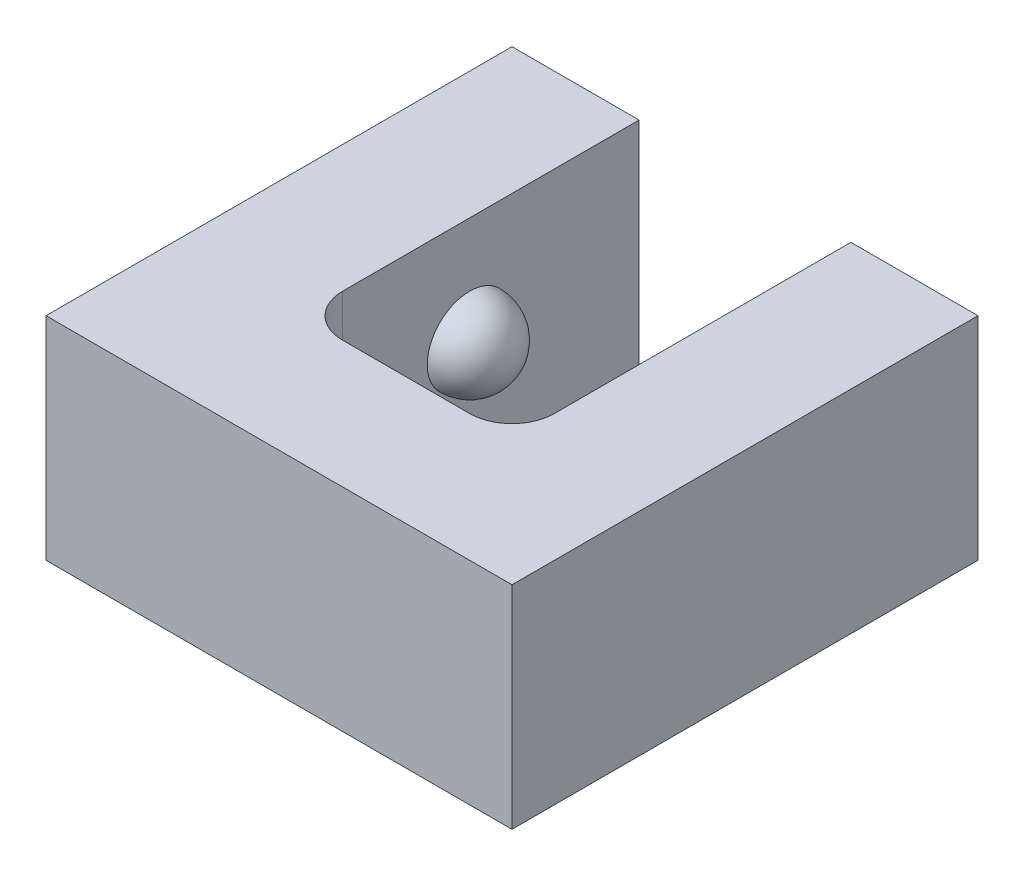
ISO-10303-21;
HEADER;
FILE_DESCRIPTION(('STEP AP214'),'2;1');
FILE_NAME('part.step','',(''),(''),'','','');
FILE_SCHEMA(('AUTOMOTIVE_DESIGN { 1 0 10303 214 1 1 1 1 }'));
ENDSEC;
DATA;
#1=APPLICATION_CONTEXT('core data for automotive mechanical design processes');
#2=APPLICATION_PROTOCOL_DEFINITION('international standard','automotive_design',2000,#1);
#3=PRODUCT_CONTEXT('',#1,'mechanical');
#4=PRODUCT('Part','Part','',(#3));
#5=PRODUCT_RELATED_PRODUCT_CATEGORY('part','',(#4));
#6=PRODUCT_DEFINITION_FORMATION('','',#4);
#7=PRODUCT_DEFINITION_CONTEXT('part definition',#1,'design');
#8=PRODUCT_DEFINITION('design','',#6,#7);
#9=PRODUCT_DEFINITION_SHAPE('','',#8);
#10=(LENGTH_UNIT() NAMED_UNIT(*) SI_UNIT(.MILLI.,.METRE.));
#11=(NAMED_UNIT(*) PLANE_ANGLE_UNIT() SI_UNIT($,.RADIAN.));
#12=(NAMED_UNIT(*) SI_UNIT($,.STERADIAN.) SOLID_ANGLE_UNIT());
#13=UNCERTAINTY_MEASURE_WITH_UNIT(LENGTH_MEASURE(1.E-05),#10,'distance_accuracy_value','');
#14=(GEOMETRIC_REPRESENTATION_CONTEXT(3) GLOBAL_UNCERTAINTY_ASSIGNED_CONTEXT((#13)) GLOBAL_UNIT_ASSIGNED_CONTEXT((#10,
#11,#12)) REPRESENTATION_CONTEXT('',''));
#15=CARTESIAN_POINT('',(0.,0.,0.));
#16=DIRECTION('',(0.,0.,1.));
#17=DIRECTION('',(1.,0.,0.));
#18=AXIS2_PLACEMENT_3D('',#15,#16,#17);
#19=CARTESIAN_POINT('',(-5.5,5.,0.));
#20=DIRECTION('',(-1.,0.,0.));
#21=DIRECTION('',(0.,0.,1.));
#22=AXIS2_PLACEMENT_3D('',#19,#20,#21);
#23=PLANE('',#22);
#24=DIRECTION('',(0.,0.,-1.));
#25=VECTOR('',#24,1.);
#26=CARTESIAN_POINT('',(-5.5,0.,0.));
#27=LINE('',#26,#25);
#28=CARTESIAN_POINT('',(-5.5,0.,5.5));
#29=VERTEX_POINT('',#28);
#30=CARTESIAN_POINT('',(-5.5,0.,-5.5));
#31=VERTEX_POINT('',#30);
#32=EDGE_CURVE('E129',#29,#31,#27,.T.);
#33=ORIENTED_EDGE('',*,*,#32,.F.);
#34=DIRECTION('',(0.,-1.,0.));
#35=VECTOR('',#34,1.);
#36=CARTESIAN_POINT('',(-5.5,5.,5.5));
#37=LINE('',#36,#35);
#38=CARTESIAN_POINT('',(-5.5,5.,5.5));
#39=VERTEX_POINT('',#38);
#40=EDGE_CURVE('E123',#39,#29,#37,.T.);
#41=ORIENTED_EDGE('',*,*,#40,.F.);
#42=DIRECTION('',(0.,0.,-1.));
#43=VECTOR('',#42,1.);
#44=CARTESIAN_POINT('',(-5.5,5.,0.));
#45=LINE('',#44,#43);
#46=CARTESIAN_POINT('',(-5.5,5.,-5.5));
#47=VERTEX_POINT('',#46);
#48=EDGE_CURVE('E126',#39,#47,#45,.T.);
#49=ORIENTED_EDGE('',*,*,#48,.T.);
#50=DIRECTION('',(0.,-1.,0.));
#51=VECTOR('',#50,1.);
#52=CARTESIAN_POINT('',(-5.5,5.,-5.5));
#53=LINE('',#52,#51);
#54=EDGE_CURVE('E177',#47,#31,#53,.T.);
#55=ORIENTED_EDGE('',*,*,#54,.T.);
#56=EDGE_LOOP('',(#33,#41,#49,#55));
#57=FACE_BOUND('',#56,.T.);
#58=ADVANCED_FACE('F47',(#57),#23,.T.);
#59=CARTESIAN_POINT('',(0.,5.,5.5));
#60=DIRECTION('',(0.,0.,-1.));
#61=DIRECTION('',(-1.,0.,0.));
#62=AXIS2_PLACEMENT_3D('',#59,#60,#61);
#63=PLANE('',#62);
#64=DIRECTION('',(1.,0.,0.));
#65=VECTOR('',#64,1.);
#66=CARTESIAN_POINT('',(0.,0.,5.5));
#67=LINE('',#66,#65);
#68=CARTESIAN_POINT('',(5.5,0.,5.5));
#69=VERTEX_POINT('',#68);
#70=EDGE_CURVE('E164',#29,#69,#67,.T.);
#71=ORIENTED_EDGE('',*,*,#70,.T.);
#72=DIRECTION('',(0.,-1.,0.));
#73=VECTOR('',#72,1.);
#74=CARTESIAN_POINT('',(5.5,5.,5.5));
#75=LINE('',#74,#73);
#76=CARTESIAN_POINT('',(5.5,5.,5.5));
#77=VERTEX_POINT('',#76);
#78=EDGE_CURVE('E133',#77,#69,#75,.T.);
#79=ORIENTED_EDGE('',*,*,#78,.F.);
#80=DIRECTION('',(1.,0.,0.));
#81=VECTOR('',#80,1.);
#82=CARTESIAN_POINT('',(0.,5.,5.5));
#83=LINE('',#82,#81);
#84=EDGE_CURVE('E136',#39,#77,#83,.T.);
#85=ORIENTED_EDGE('',*,*,#84,.F.);
#86=ORIENTED_EDGE('',*,*,#40,.T.);
#87=EDGE_LOOP('',(#71,#79,#85,#86));
#88=FACE_BOUND('',#87,.T.);
#89=ADVANCED_FACE('F137',(#88),#63,.F.);
#90=CARTESIAN_POINT('',(5.5,5.,0.));
#91=DIRECTION('',(-1.,0.,0.));
#92=DIRECTION('',(0.,0.,1.));
#93=AXIS2_PLACEMENT_3D('',#90,#91,#92);
#94=PLANE('',#93);
#95=DIRECTION('',(0.,0.,-1.));
#96=VECTOR('',#95,1.);
#97=CARTESIAN_POINT('',(5.5,0.,0.));
#98=LINE('',#97,#96);
#99=CARTESIAN_POINT('',(5.5,0.,-5.5));
#100=VERTEX_POINT('',#99);
#101=EDGE_CURVE('E167',#69,#100,#98,.T.);
#102=ORIENTED_EDGE('',*,*,#101,.T.);
#103=DIRECTION('',(0.,-1.,0.));
#104=VECTOR('',#103,1.);
#105=CARTESIAN_POINT('',(5.5,5.,-5.5));
#106=LINE('',#105,#104);
#107=CARTESIAN_POINT('',(5.5,5.,-5.5));
#108=VERTEX_POINT('',#107);
#109=EDGE_CURVE('E185',#108,#100,#106,.T.);
#110=ORIENTED_EDGE('',*,*,#109,.F.);
#111=DIRECTION('',(0.,0.,-1.));
#112=VECTOR('',#111,1.);
#113=CARTESIAN_POINT('',(5.5,5.,0.));
#114=LINE('',#113,#112);
#115=EDGE_CURVE('E140',#77,#108,#114,.T.);
#116=ORIENTED_EDGE('',*,*,#115,.F.);
#117=ORIENTED_EDGE('',*,*,#78,.T.);
#118=EDGE_LOOP('',(#102,#110,#116,#117));
#119=FACE_BOUND('',#118,.T.);
#120=ADVANCED_FACE('F219',(#119),#94,.F.);
#121=CARTESIAN_POINT('',(0.,5.,-5.5));
#122=DIRECTION('',(0.,0.,-1.));
#123=DIRECTION('',(-1.,0.,0.));
#124=AXIS2_PLACEMENT_3D('',#121,#122,#123);
#125=PLANE('',#124);
#126=DIRECTION('',(1.,0.,0.));
#127=VECTOR('',#126,1.);
#128=CARTESIAN_POINT('',(0.,0.,-5.5));
#129=LINE('',#128,#127);
#130=CARTESIAN_POINT('',(2.5,0.,-5.5));
#131=VERTEX_POINT('',#130);
#132=EDGE_CURVE('E150',#131,#100,#129,.T.);
#133=ORIENTED_EDGE('',*,*,#132,.F.);
#134=DIRECTION('',(0.,-1.,0.));
#135=VECTOR('',#134,1.);
#136=CARTESIAN_POINT('',(2.5,5.,-5.5));
#137=LINE('',#136,#135);
#138=CARTESIAN_POINT('',(2.5,5.,-5.5));
#139=VERTEX_POINT('',#138);
#140=EDGE_CURVE('E182',#139,#131,#137,.T.);
#141=ORIENTED_EDGE('',*,*,#140,.F.);
#142=DIRECTION('',(1.,0.,0.));
#143=VECTOR('',#142,1.);
#144=CARTESIAN_POINT('',(0.,5.,-5.5));
#145=LINE('',#144,#143);
#146=EDGE_CURVE('E153',#139,#108,#145,.T.);
#147=ORIENTED_EDGE('',*,*,#146,.T.);
#148=ORIENTED_EDGE('',*,*,#109,.T.);
#149=EDGE_LOOP('',(#133,#141,#147,#148));
#150=FACE_BOUND('',#149,.T.);
#151=ADVANCED_FACE('F227',(#150),#125,.T.);
#152=CARTESIAN_POINT('',(2.5,5.,0.));
#153=DIRECTION('',(-1.,0.,0.));
#154=DIRECTION('',(0.,0.,1.));
#155=AXIS2_PLACEMENT_3D('',#152,#153,#154);
#156=PLANE('',#155);
#157=CARTESIAN_POINT('',(2.5,2.5,-1.5));
#158=DIRECTION('',(-1.,0.,0.));
#159=DIRECTION('',(0.,0.,1.));
#160=AXIS2_PLACEMENT_3D('',#157,#158,#159);
#161=CIRCLE('',#160,1.);
#162=CARTESIAN_POINT('',(2.5,2.5,-0.5));
#163=VERTEX_POINT('',#162);
#164=EDGE_CURVE('E165',#163,#163,#161,.F.);
#165=ORIENTED_EDGE('',*,*,#164,.T.);
#166=EDGE_LOOP('',(#165));
#167=FACE_BOUND('',#166,.T.);
#168=DIRECTION('',(0.,0.,-1.));
#169=VECTOR('',#168,1.);
#170=CARTESIAN_POINT('',(2.5,0.,0.));
#171=LINE('',#170,#169);
#172=CARTESIAN_POINT('',(2.5,0.,1.5));
#173=VERTEX_POINT('',#172);
#174=EDGE_CURVE('E171',#173,#131,#171,.T.);
#175=ORIENTED_EDGE('',*,*,#174,.F.);
#176=DIRECTION('',(0.,-1.,0.));
#177=VECTOR('',#176,1.);
#178=CARTESIAN_POINT('',(2.5,5.,1.5));
#179=LINE('',#178,#177);
#180=CARTESIAN_POINT('',(2.5,5.,1.5));
#181=VERTEX_POINT('',#180);
#182=EDGE_CURVE('E197',#173,#181,#179,.F.);
#183=ORIENTED_EDGE('',*,*,#182,.T.);
#184=DIRECTION('',(0.,0.,-1.));
#185=VECTOR('',#184,1.);
#186=CARTESIAN_POINT('',(2.5,5.,0.));
#187=LINE('',#186,#185);
#188=EDGE_CURVE('E156',#181,#139,#187,.T.);
#189=ORIENTED_EDGE('',*,*,#188,.T.);
#190=ORIENTED_EDGE('',*,*,#140,.T.);
#191=EDGE_LOOP('',(#175,#183,#189,#190));
#192=FACE_BOUND('',#191,.T.);
#193=ADVANCED_FACE('F230',(#167,#192),#156,.T.);
#194=CARTESIAN_POINT('',(0.,5.,2.5));
#195=DIRECTION('',(0.,0.,-1.));
#196=DIRECTION('',(-1.,0.,0.));
#197=AXIS2_PLACEMENT_3D('',#194,#195,#196);
#198=PLANE('',#197);
#199=DIRECTION('',(1.,0.,0.));
#200=VECTOR('',#199,1.);
#201=CARTESIAN_POINT('',(0.,5.,2.5));
#202=LINE('',#201,#200);
#203=CARTESIAN_POINT('',(-1.5,5.,2.5));
#204=VERTEX_POINT('',#203);
#205=CARTESIAN_POINT('',(1.5,5.,2.5));
#206=VERTEX_POINT('',#205);
#207=EDGE_CURVE('E158',#204,#206,#202,.T.);
#208=ORIENTED_EDGE('',*,*,#207,.T.);
#209=DIRECTION('',(0.,-1.,0.));
#210=VECTOR('',#209,1.);
#211=CARTESIAN_POINT('',(1.5,0.,2.5));
#212=LINE('',#211,#210);
#213=CARTESIAN_POINT('',(1.5,0.,2.5));
#214=VERTEX_POINT('',#213);
#215=EDGE_CURVE('E194',#206,#214,#212,.T.);
#216=ORIENTED_EDGE('',*,*,#215,.T.);
#217=DIRECTION('',(1.,0.,0.));
#218=VECTOR('',#217,1.);
#219=CARTESIAN_POINT('',(0.,0.,2.5));
#220=LINE('',#219,#218);
#221=CARTESIAN_POINT('',(-1.5,0.,2.5));
#222=VERTEX_POINT('',#221);
#223=EDGE_CURVE('E173',#222,#214,#220,.T.);
#224=ORIENTED_EDGE('',*,*,#223,.F.);
#225=DIRECTION('',(0.,-1.,0.));
#226=VECTOR('',#225,1.);
#227=CARTESIAN_POINT('',(-1.5,5.,2.5));
#228=LINE('',#227,#226);
#229=EDGE_CURVE('E190',#222,#204,#228,.F.);
#230=ORIENTED_EDGE('',*,*,#229,.T.);
#231=EDGE_LOOP('',(#208,#216,#224,#230));
#232=FACE_BOUND('',#231,.T.);
#233=ADVANCED_FACE('F209',(#232),#198,.T.);
#234=CARTESIAN_POINT('',(-2.5,5.,0.));
#235=DIRECTION('',(-1.,0.,0.));
#236=DIRECTION('',(0.,0.,1.));
#237=AXIS2_PLACEMENT_3D('',#234,#235,#236);
#238=PLANE('',#237);
#239=CARTESIAN_POINT('',(-2.5,2.5,-1.5));
#240=DIRECTION('',(-1.,0.,0.));
#241=DIRECTION('',(0.,0.,1.));
#242=AXIS2_PLACEMENT_3D('',#239,#240,#241);
#243=CIRCLE('',#242,1.);
#244=CARTESIAN_POINT('',(-2.5,2.5,-0.5));
#245=VERTEX_POINT('',#244);
#246=EDGE_CURVE('E132',#245,#245,#243,.F.);
#247=ORIENTED_EDGE('',*,*,#246,.F.);
#248=EDGE_LOOP('',(#247));
#249=FACE_BOUND('',#248,.T.);
#250=DIRECTION('',(0.,0.,-1.));
#251=VECTOR('',#250,1.);
#252=CARTESIAN_POINT('',(-2.5,5.,0.));
#253=LINE('',#252,#251);
#254=CARTESIAN_POINT('',(-2.5,5.,1.5));
#255=VERTEX_POINT('',#254);
#256=CARTESIAN_POINT('',(-2.5,5.,-5.5));
#257=VERTEX_POINT('',#256);
#258=EDGE_CURVE('E161',#255,#257,#253,.T.);
#259=ORIENTED_EDGE('',*,*,#258,.F.);
#260=DIRECTION('',(0.,-1.,0.));
#261=VECTOR('',#260,1.);
#262=CARTESIAN_POINT('',(-2.5,5.,1.5));
#263=LINE('',#262,#261);
#264=CARTESIAN_POINT('',(-2.5,0.,1.5));
#265=VERTEX_POINT('',#264);
#266=EDGE_CURVE('E199',#255,#265,#263,.T.);
#267=ORIENTED_EDGE('',*,*,#266,.T.);
#268=DIRECTION('',(0.,0.,-1.));
#269=VECTOR('',#268,1.);
#270=CARTESIAN_POINT('',(-2.5,0.,0.));
#271=LINE('',#270,#269);
#272=CARTESIAN_POINT('',(-2.5,0.,-5.5));
#273=VERTEX_POINT('',#272);
#274=EDGE_CURVE('E148',#265,#273,#271,.T.);
#275=ORIENTED_EDGE('',*,*,#274,.T.);
#276=DIRECTION('',(0.,-1.,0.));
#277=VECTOR('',#276,1.);
#278=CARTESIAN_POINT('',(-2.5,5.,-5.5));
#279=LINE('',#278,#277);
#280=EDGE_CURVE('E179',#257,#273,#279,.T.);
#281=ORIENTED_EDGE('',*,*,#280,.F.);
#282=EDGE_LOOP('',(#259,#267,#275,#281));
#283=FACE_BOUND('',#282,.T.);
#284=ADVANCED_FACE('F212',(#249,#283),#238,.F.);
#285=EDGE_CURVE('E145',#31,#273,#129,.T.);
#286=ORIENTED_EDGE('',*,*,#285,.F.);
#287=ORIENTED_EDGE('',*,*,#54,.F.);
#288=EDGE_CURVE('E144',#47,#257,#145,.T.);
#289=ORIENTED_EDGE('',*,*,#288,.T.);
#290=ORIENTED_EDGE('',*,*,#280,.T.);
#291=EDGE_LOOP('',(#286,#287,#289,#290));
#292=FACE_BOUND('',#291,.T.);
#293=ADVANCED_FACE('F216',(#292),#125,.T.);
#294=CARTESIAN_POINT('',(0.,5.,0.));
#295=DIRECTION('',(0.,1.,0.));
#296=DIRECTION('',(0.,0.,1.));
#297=AXIS2_PLACEMENT_3D('',#294,#295,#296);
#298=PLANE('',#297);
#299=ORIENTED_EDGE('',*,*,#48,.F.);
#300=ORIENTED_EDGE('',*,*,#84,.T.);
#301=ORIENTED_EDGE('',*,*,#115,.T.);
#302=ORIENTED_EDGE('',*,*,#146,.F.);
#303=ORIENTED_EDGE('',*,*,#188,.F.);
#304=CARTESIAN_POINT('',(1.5,5.,1.5));
#305=DIRECTION('',(0.,1.,0.));
#306=DIRECTION('',(0.,0.,1.));
#307=AXIS2_PLACEMENT_3D('',#304,#305,#306);
#308=CIRCLE('',#307,1.);
#309=EDGE_CURVE('E203',#181,#206,#308,.F.);
#310=ORIENTED_EDGE('',*,*,#309,.T.);
#311=ORIENTED_EDGE('',*,*,#207,.F.);
#312=CARTESIAN_POINT('',(-1.5,5.,1.5));
#313=DIRECTION('',(0.,1.,0.));
#314=DIRECTION('',(0.,0.,1.));
#315=AXIS2_PLACEMENT_3D('',#312,#313,#314);
#316=CIRCLE('',#315,1.);
#317=EDGE_CURVE('E13',#204,#255,#316,.F.);
#318=ORIENTED_EDGE('',*,*,#317,.T.);
#319=ORIENTED_EDGE('',*,*,#258,.T.);
#320=ORIENTED_EDGE('',*,*,#288,.F.);
#321=EDGE_LOOP('',(#299,#300,#301,#302,#303,#310,#311,#318,#319,#320));
#322=FACE_BOUND('',#321,.T.);
#323=ADVANCED_FACE('F142',(#322),#298,.T.);
#324=CARTESIAN_POINT('',(0.,0.,0.));
#325=DIRECTION('',(0.,1.,0.));
#326=DIRECTION('',(0.,0.,1.));
#327=AXIS2_PLACEMENT_3D('',#324,#325,#326);
#328=PLANE('',#327);
#329=ORIENTED_EDGE('',*,*,#32,.T.);
#330=ORIENTED_EDGE('',*,*,#285,.T.);
#331=ORIENTED_EDGE('',*,*,#274,.F.);
#332=CARTESIAN_POINT('',(-1.5,0.,1.5));
#333=DIRECTION('',(0.,1.,0.));
#334=DIRECTION('',(0.,0.,1.));
#335=AXIS2_PLACEMENT_3D('',#332,#333,#334);
#336=CIRCLE('',#335,1.);
#337=EDGE_CURVE('E55',#265,#222,#336,.T.);
#338=ORIENTED_EDGE('',*,*,#337,.T.);
#339=ORIENTED_EDGE('',*,*,#223,.T.);
#340=CARTESIAN_POINT('',(1.5,0.,1.5));
#341=DIRECTION('',(0.,1.,0.));
#342=DIRECTION('',(0.,0.,1.));
#343=AXIS2_PLACEMENT_3D('',#340,#341,#342);
#344=CIRCLE('',#343,1.);
#345=EDGE_CURVE('E201',#214,#173,#344,.T.);
#346=ORIENTED_EDGE('',*,*,#345,.T.);
#347=ORIENTED_EDGE('',*,*,#174,.T.);
#348=ORIENTED_EDGE('',*,*,#132,.T.);
#349=ORIENTED_EDGE('',*,*,#101,.F.);
#350=ORIENTED_EDGE('',*,*,#70,.F.);
#351=EDGE_LOOP('',(#329,#330,#331,#338,#339,#346,#347,#348,#349,#350));
#352=FACE_BOUND('',#351,.T.);
#353=ADVANCED_FACE('F207',(#352),#328,.F.);
#354=CARTESIAN_POINT('',(-2.5,2.5,-1.5));
#355=DIRECTION('',(0.,0.,-1.));
#356=DIRECTION('',(0.,-1.,0.));
#357=AXIS2_PLACEMENT_3D('',#354,#355,#356);
#358=SPHERICAL_SURFACE('',#357,1.);
#359=CARTESIAN_POINT('',(-2.5,2.5,-1.5));
#360=DIRECTION('',(-1.,0.,0.));
#361=DIRECTION('',(0.,0.,1.));
#362=AXIS2_PLACEMENT_3D('',#359,#360,#361);
#363=SPHERICAL_SURFACE('',#362,1.);
#364=ORIENTED_EDGE('',*,*,#246,.T.);
#365=EDGE_LOOP('',(#364));
#366=FACE_BOUND('',#365,.T.);
#367=ADVANCED_FACE('F240',(#366),#363,.T.);
#368=CARTESIAN_POINT('',(2.5,2.5,-1.5));
#369=DIRECTION('',(0.,0.,-1.));
#370=DIRECTION('',(0.,-1.,0.));
#371=AXIS2_PLACEMENT_3D('',#368,#369,#370);
#372=SPHERICAL_SURFACE('',#371,1.);
#373=CARTESIAN_POINT('',(2.5,2.5,-1.5));
#374=DIRECTION('',(-1.,0.,0.));
#375=DIRECTION('',(0.,0.,1.));
#376=AXIS2_PLACEMENT_3D('',#373,#374,#375);
#377=SPHERICAL_SURFACE('',#376,1.);
#378=ORIENTED_EDGE('',*,*,#164,.F.);
#379=EDGE_LOOP('',(#378));
#380=FACE_BOUND('',#379,.T.);
#381=ADVANCED_FACE('F235',(#380),#377,.T.);
#382=CARTESIAN_POINT('',(1.5,5.,1.5));
#383=DIRECTION('',(0.,1.,0.));
#384=DIRECTION('',(0.,0.,1.));
#385=AXIS2_PLACEMENT_3D('',#382,#383,#384);
#386=CYLINDRICAL_SURFACE('',#385,1.);
#387=ORIENTED_EDGE('',*,*,#309,.F.);
#388=ORIENTED_EDGE('',*,*,#182,.F.);
#389=ORIENTED_EDGE('',*,*,#345,.F.);
#390=ORIENTED_EDGE('',*,*,#215,.F.);
#391=EDGE_LOOP('',(#387,#388,#389,#390));
#392=FACE_BOUND('',#391,.T.);
#393=ADVANCED_FACE('F233',(#392),#386,.F.);
#394=CARTESIAN_POINT('',(-1.5,5.,1.5));
#395=DIRECTION('',(0.,-1.,0.));
#396=DIRECTION('',(0.,0.,-1.));
#397=AXIS2_PLACEMENT_3D('',#394,#395,#396);
#398=CYLINDRICAL_SURFACE('',#397,1.);
#399=ORIENTED_EDGE('',*,*,#317,.F.);
#400=ORIENTED_EDGE('',*,*,#229,.F.);
#401=ORIENTED_EDGE('',*,*,#337,.F.);
#402=ORIENTED_EDGE('',*,*,#266,.F.);
#403=EDGE_LOOP('',(#399,#400,#401,#402));
#404=FACE_BOUND('',#403,.T.);
#405=ADVANCED_FACE('F49',(#404),#398,.F.);
#406=CLOSED_SHELL('',(#58,#89,#120,#151,#193,#233,#284,#293,#323,#353,#367,#381,#393,#405));
#407=MANIFOLD_SOLID_BREP('B2',#406);
#408=ADVANCED_BREP_SHAPE_REPRESENTATION('',(#18,#407),#14);
#409=SHAPE_DEFINITION_REPRESENTATION(#9,#408);
ENDSEC;
END-ISO-10303-21;
